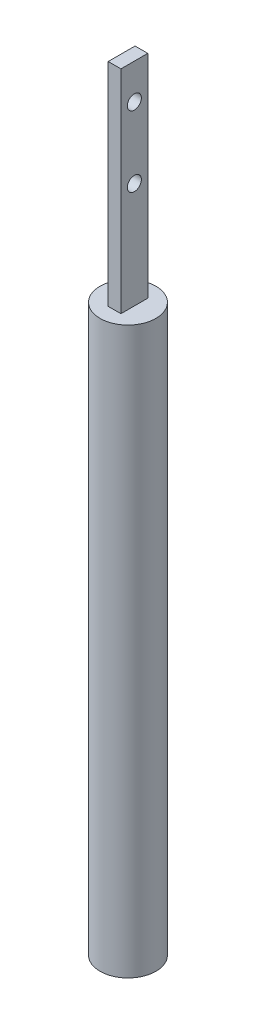
ISO-10303-21;
HEADER;
FILE_DESCRIPTION(('STEP AP214'),'2;1');
FILE_NAME('part.step','',(''),(''),'','','');
FILE_SCHEMA(('AUTOMOTIVE_DESIGN { 1 0 10303 214 1 1 1 1 }'));
ENDSEC;
DATA;
#1=APPLICATION_CONTEXT('core data for automotive mechanical design processes');
#2=APPLICATION_PROTOCOL_DEFINITION('international standard','automotive_design',2000,#1);
#3=PRODUCT_CONTEXT('',#1,'mechanical');
#4=PRODUCT('Part','Part','',(#3));
#5=PRODUCT_RELATED_PRODUCT_CATEGORY('part','',(#4));
#6=PRODUCT_DEFINITION_FORMATION('','',#4);
#7=PRODUCT_DEFINITION_CONTEXT('part definition',#1,'design');
#8=PRODUCT_DEFINITION('design','',#6,#7);
#9=PRODUCT_DEFINITION_SHAPE('','',#8);
#10=(LENGTH_UNIT() NAMED_UNIT(*) SI_UNIT(.MILLI.,.METRE.));
#11=(NAMED_UNIT(*) PLANE_ANGLE_UNIT() SI_UNIT($,.RADIAN.));
#12=(NAMED_UNIT(*) SI_UNIT($,.STERADIAN.) SOLID_ANGLE_UNIT());
#13=UNCERTAINTY_MEASURE_WITH_UNIT(LENGTH_MEASURE(1.E-05),#10,'distance_accuracy_value','');
#14=(GEOMETRIC_REPRESENTATION_CONTEXT(3) GLOBAL_UNCERTAINTY_ASSIGNED_CONTEXT((#13)) GLOBAL_UNIT_ASSIGNED_CONTEXT((#10,
#11,#12)) REPRESENTATION_CONTEXT('',''));
#15=CARTESIAN_POINT('',(0.,0.,0.));
#16=DIRECTION('',(0.,0.,1.));
#17=DIRECTION('',(1.,0.,0.));
#18=AXIS2_PLACEMENT_3D('',#15,#16,#17);
#19=CARTESIAN_POINT('',(0.,80.,0.));
#20=DIRECTION('',(0.,1.,0.));
#21=DIRECTION('',(0.,0.,1.));
#22=AXIS2_PLACEMENT_3D('',#19,#20,#21);
#23=PLANE('',#22);
#24=CARTESIAN_POINT('',(0.,80.,0.));
#25=DIRECTION('',(0.,1.,0.));
#26=DIRECTION('',(0.,0.,1.));
#27=AXIS2_PLACEMENT_3D('',#24,#25,#26);
#28=CIRCLE('',#27,3.95);
#29=CARTESIAN_POINT('',(0.,80.,3.95));
#30=VERTEX_POINT('',#29);
#31=EDGE_CURVE('E11',#30,#30,#28,.T.);
#32=ORIENTED_EDGE('',*,*,#31,.T.);
#33=EDGE_LOOP('',(#32));
#34=FACE_BOUND('',#33,.T.);
#35=DIRECTION('',(-1.,0.,0.));
#36=VECTOR('',#35,1.);
#37=CARTESIAN_POINT('',(-0.9,80.,-1.9));
#38=LINE('',#37,#36);
#39=CARTESIAN_POINT('',(0.9,80.,-1.9));
#40=VERTEX_POINT('',#39);
#41=CARTESIAN_POINT('',(-0.9,80.,-1.9));
#42=VERTEX_POINT('',#41);
#43=EDGE_CURVE('E89',#40,#42,#38,.T.);
#44=ORIENTED_EDGE('',*,*,#43,.F.);
#45=DIRECTION('',(0.,0.,-1.));
#46=VECTOR('',#45,1.);
#47=CARTESIAN_POINT('',(0.9,80.,1.9));
#48=LINE('',#47,#46);
#49=CARTESIAN_POINT('',(0.9,80.,1.9));
#50=VERTEX_POINT('',#49);
#51=EDGE_CURVE('E100',#50,#40,#48,.T.);
#52=ORIENTED_EDGE('',*,*,#51,.F.);
#53=DIRECTION('',(1.,0.,0.));
#54=VECTOR('',#53,1.);
#55=CARTESIAN_POINT('',(-0.9,80.,1.9));
#56=LINE('',#55,#54);
#57=CARTESIAN_POINT('',(-0.9,80.,1.9));
#58=VERTEX_POINT('',#57);
#59=EDGE_CURVE('E70',#58,#50,#56,.T.);
#60=ORIENTED_EDGE('',*,*,#59,.F.);
#61=DIRECTION('',(0.,0.,1.));
#62=VECTOR('',#61,1.);
#63=CARTESIAN_POINT('',(-0.9,80.,1.9));
#64=LINE('',#63,#62);
#65=EDGE_CURVE('E105',#42,#58,#64,.T.);
#66=ORIENTED_EDGE('',*,*,#65,.F.);
#67=EDGE_LOOP('',(#44,#52,#60,#66));
#68=FACE_BOUND('',#67,.T.);
#69=ADVANCED_FACE('F33',(#34,#68),#23,.T.);
#70=CARTESIAN_POINT('',(0.,80.,0.));
#71=DIRECTION('',(0.,-1.,0.));
#72=DIRECTION('',(0.,0.,-1.));
#73=AXIS2_PLACEMENT_3D('',#70,#71,#72);
#74=CYLINDRICAL_SURFACE('',#73,3.95);
#75=ORIENTED_EDGE('',*,*,#31,.F.);
#76=EDGE_LOOP('',(#75));
#77=FACE_BOUND('',#76,.T.);
#78=CARTESIAN_POINT('',(0.,0.,0.));
#79=DIRECTION('',(0.,1.,0.));
#80=DIRECTION('',(0.,0.,1.));
#81=AXIS2_PLACEMENT_3D('',#78,#79,#80);
#82=CIRCLE('',#81,3.95);
#83=CARTESIAN_POINT('',(0.,0.,3.95));
#84=VERTEX_POINT('',#83);
#85=EDGE_CURVE('E37',#84,#84,#82,.T.);
#86=ORIENTED_EDGE('',*,*,#85,.T.);
#87=EDGE_LOOP('',(#86));
#88=FACE_BOUND('',#87,.T.);
#89=ADVANCED_FACE('F35',(#77,#88),#74,.T.);
#90=CARTESIAN_POINT('',(0.,0.,0.));
#91=DIRECTION('',(0.,1.,0.));
#92=DIRECTION('',(0.,0.,1.));
#93=AXIS2_PLACEMENT_3D('',#90,#91,#92);
#94=PLANE('',#93);
#95=ORIENTED_EDGE('',*,*,#85,.F.);
#96=EDGE_LOOP('',(#95));
#97=FACE_BOUND('',#96,.T.);
#98=ADVANCED_FACE('F114',(#97),#94,.F.);
#99=CARTESIAN_POINT('',(0.9,110.,1.9));
#100=DIRECTION('',(-1.,0.,0.));
#101=DIRECTION('',(0.,0.,1.));
#102=AXIS2_PLACEMENT_3D('',#99,#100,#101);
#103=PLANE('',#102);
#104=CARTESIAN_POINT('',(0.9,95.,0.));
#105=DIRECTION('',(1.,0.,0.));
#106=DIRECTION('',(0.,0.,-1.));
#107=AXIS2_PLACEMENT_3D('',#104,#105,#106);
#108=CIRCLE('',#107,1.);
#109=CARTESIAN_POINT('',(0.9,95.,-1.));
#110=VERTEX_POINT('',#109);
#111=EDGE_CURVE('E156',#110,#110,#108,.T.);
#112=ORIENTED_EDGE('',*,*,#111,.F.);
#113=EDGE_LOOP('',(#112));
#114=FACE_BOUND('',#113,.T.);
#115=CARTESIAN_POINT('',(0.9,105.,0.));
#116=DIRECTION('',(1.,0.,0.));
#117=DIRECTION('',(0.,0.,-1.));
#118=AXIS2_PLACEMENT_3D('',#115,#116,#117);
#119=CIRCLE('',#118,1.);
#120=CARTESIAN_POINT('',(0.9,105.,-1.));
#121=VERTEX_POINT('',#120);
#122=EDGE_CURVE('E158',#121,#121,#119,.T.);
#123=ORIENTED_EDGE('',*,*,#122,.F.);
#124=EDGE_LOOP('',(#123));
#125=FACE_BOUND('',#124,.T.);
#126=ORIENTED_EDGE('',*,*,#51,.T.);
#127=DIRECTION('',(0.,-1.,0.));
#128=VECTOR('',#127,1.);
#129=CARTESIAN_POINT('',(0.9,110.,-1.9));
#130=LINE('',#129,#128);
#131=CARTESIAN_POINT('',(0.9,110.,-1.9));
#132=VERTEX_POINT('',#131);
#133=EDGE_CURVE('E92',#132,#40,#130,.T.);
#134=ORIENTED_EDGE('',*,*,#133,.F.);
#135=DIRECTION('',(0.,0.,-1.));
#136=VECTOR('',#135,1.);
#137=CARTESIAN_POINT('',(0.9,110.,1.9));
#138=LINE('',#137,#136);
#139=CARTESIAN_POINT('',(0.9,110.,1.9));
#140=VERTEX_POINT('',#139);
#141=EDGE_CURVE('E82',#140,#132,#138,.T.);
#142=ORIENTED_EDGE('',*,*,#141,.F.);
#143=DIRECTION('',(0.,-1.,0.));
#144=VECTOR('',#143,1.);
#145=CARTESIAN_POINT('',(0.9,110.,1.9));
#146=LINE('',#145,#144);
#147=EDGE_CURVE('E96',#140,#50,#146,.T.);
#148=ORIENTED_EDGE('',*,*,#147,.T.);
#149=EDGE_LOOP('',(#126,#134,#142,#148));
#150=FACE_BOUND('',#149,.T.);
#151=ADVANCED_FACE('F116',(#114,#125,#150),#103,.F.);
#152=CARTESIAN_POINT('',(-0.9,110.,-1.9));
#153=DIRECTION('',(0.,0.,1.));
#154=DIRECTION('',(1.,0.,0.));
#155=AXIS2_PLACEMENT_3D('',#152,#153,#154);
#156=PLANE('',#155);
#157=ORIENTED_EDGE('',*,*,#43,.T.);
#158=DIRECTION('',(0.,-1.,0.));
#159=VECTOR('',#158,1.);
#160=CARTESIAN_POINT('',(-0.9,110.,-1.9));
#161=LINE('',#160,#159);
#162=CARTESIAN_POINT('',(-0.9,110.,-1.9));
#163=VERTEX_POINT('',#162);
#164=EDGE_CURVE('E86',#163,#42,#161,.T.);
#165=ORIENTED_EDGE('',*,*,#164,.F.);
#166=DIRECTION('',(-1.,0.,0.));
#167=VECTOR('',#166,1.);
#168=CARTESIAN_POINT('',(-0.9,110.,-1.9));
#169=LINE('',#168,#167);
#170=EDGE_CURVE('E77',#132,#163,#169,.T.);
#171=ORIENTED_EDGE('',*,*,#170,.F.);
#172=ORIENTED_EDGE('',*,*,#133,.T.);
#173=EDGE_LOOP('',(#157,#165,#171,#172));
#174=FACE_BOUND('',#173,.T.);
#175=ADVANCED_FACE('F87',(#174),#156,.F.);
#176=CARTESIAN_POINT('',(-0.9,110.,1.9));
#177=DIRECTION('',(1.,0.,0.));
#178=DIRECTION('',(0.,0.,-1.));
#179=AXIS2_PLACEMENT_3D('',#176,#177,#178);
#180=PLANE('',#179);
#181=CARTESIAN_POINT('',(-0.9,95.,0.));
#182=DIRECTION('',(1.,0.,0.));
#183=DIRECTION('',(0.,0.,-1.));
#184=AXIS2_PLACEMENT_3D('',#181,#182,#183);
#185=CIRCLE('',#184,1.);
#186=CARTESIAN_POINT('',(-0.9,95.,-1.));
#187=VERTEX_POINT('',#186);
#188=EDGE_CURVE('E153',#187,#187,#185,.F.);
#189=ORIENTED_EDGE('',*,*,#188,.F.);
#190=EDGE_LOOP('',(#189));
#191=FACE_BOUND('',#190,.T.);
#192=CARTESIAN_POINT('',(-0.9,105.,0.));
#193=DIRECTION('',(1.,0.,0.));
#194=DIRECTION('',(0.,0.,-1.));
#195=AXIS2_PLACEMENT_3D('',#192,#193,#194);
#196=CIRCLE('',#195,1.);
#197=CARTESIAN_POINT('',(-0.9,105.,-1.));
#198=VERTEX_POINT('',#197);
#199=EDGE_CURVE('E103',#198,#198,#196,.F.);
#200=ORIENTED_EDGE('',*,*,#199,.F.);
#201=EDGE_LOOP('',(#200));
#202=FACE_BOUND('',#201,.T.);
#203=ORIENTED_EDGE('',*,*,#65,.T.);
#204=DIRECTION('',(0.,-1.,0.));
#205=VECTOR('',#204,1.);
#206=CARTESIAN_POINT('',(-0.9,110.,1.9));
#207=LINE('',#206,#205);
#208=CARTESIAN_POINT('',(-0.9,110.,1.9));
#209=VERTEX_POINT('',#208);
#210=EDGE_CURVE('E48',#209,#58,#207,.T.);
#211=ORIENTED_EDGE('',*,*,#210,.F.);
#212=DIRECTION('',(0.,0.,1.));
#213=VECTOR('',#212,1.);
#214=CARTESIAN_POINT('',(-0.9,110.,1.9));
#215=LINE('',#214,#213);
#216=EDGE_CURVE('E80',#163,#209,#215,.T.);
#217=ORIENTED_EDGE('',*,*,#216,.F.);
#218=ORIENTED_EDGE('',*,*,#164,.T.);
#219=EDGE_LOOP('',(#203,#211,#217,#218));
#220=FACE_BOUND('',#219,.T.);
#221=ADVANCED_FACE('F94',(#191,#202,#220),#180,.F.);
#222=CARTESIAN_POINT('',(-0.9,110.,1.9));
#223=DIRECTION('',(0.,0.,-1.));
#224=DIRECTION('',(-1.,0.,0.));
#225=AXIS2_PLACEMENT_3D('',#222,#223,#224);
#226=PLANE('',#225);
#227=ORIENTED_EDGE('',*,*,#59,.T.);
#228=ORIENTED_EDGE('',*,*,#147,.F.);
#229=DIRECTION('',(1.,0.,0.));
#230=VECTOR('',#229,1.);
#231=CARTESIAN_POINT('',(-0.9,110.,1.9));
#232=LINE('',#231,#230);
#233=EDGE_CURVE('E56',#209,#140,#232,.T.);
#234=ORIENTED_EDGE('',*,*,#233,.F.);
#235=ORIENTED_EDGE('',*,*,#210,.T.);
#236=EDGE_LOOP('',(#227,#228,#234,#235));
#237=FACE_BOUND('',#236,.T.);
#238=ADVANCED_FACE('F135',(#237),#226,.F.);
#239=CARTESIAN_POINT('',(0.,110.,0.));
#240=DIRECTION('',(0.,-1.,0.));
#241=DIRECTION('',(0.,0.,-1.));
#242=AXIS2_PLACEMENT_3D('',#239,#240,#241);
#243=PLANE('',#242);
#244=ORIENTED_EDGE('',*,*,#141,.T.);
#245=ORIENTED_EDGE('',*,*,#170,.T.);
#246=ORIENTED_EDGE('',*,*,#216,.T.);
#247=ORIENTED_EDGE('',*,*,#233,.T.);
#248=EDGE_LOOP('',(#244,#245,#246,#247));
#249=FACE_BOUND('',#248,.T.);
#250=ADVANCED_FACE('F78',(#249),#243,.F.);
#251=CARTESIAN_POINT('',(-3.72842712474619,105.,0.));
#252=DIRECTION('',(1.,0.,0.));
#253=DIRECTION('',(0.,0.,-1.));
#254=AXIS2_PLACEMENT_3D('',#251,#252,#253);
#255=CYLINDRICAL_SURFACE('',#254,1.);
#256=ORIENTED_EDGE('',*,*,#199,.T.);
#257=EDGE_LOOP('',(#256));
#258=FACE_BOUND('',#257,.T.);
#259=ORIENTED_EDGE('',*,*,#122,.T.);
#260=EDGE_LOOP('',(#259));
#261=FACE_BOUND('',#260,.T.);
#262=ADVANCED_FACE('F141',(#258,#261),#255,.F.);
#263=CARTESIAN_POINT('',(-3.72842712474619,95.,0.));
#264=DIRECTION('',(1.,0.,0.));
#265=DIRECTION('',(0.,0.,-1.));
#266=AXIS2_PLACEMENT_3D('',#263,#264,#265);
#267=CYLINDRICAL_SURFACE('',#266,1.);
#268=ORIENTED_EDGE('',*,*,#188,.T.);
#269=EDGE_LOOP('',(#268));
#270=FACE_BOUND('',#269,.T.);
#271=ORIENTED_EDGE('',*,*,#111,.T.);
#272=EDGE_LOOP('',(#271));
#273=FACE_BOUND('',#272,.T.);
#274=ADVANCED_FACE('F144',(#270,#273),#267,.F.);
#275=CLOSED_SHELL('',(#69,#89,#98,#151,#175,#221,#238,#250,#262,#274));
#276=MANIFOLD_SOLID_BREP('B2',#275);
#277=ADVANCED_BREP_SHAPE_REPRESENTATION('',(#18,#276),#14);
#278=SHAPE_DEFINITION_REPRESENTATION(#9,#277);
ENDSEC;
END-ISO-10303-21;
